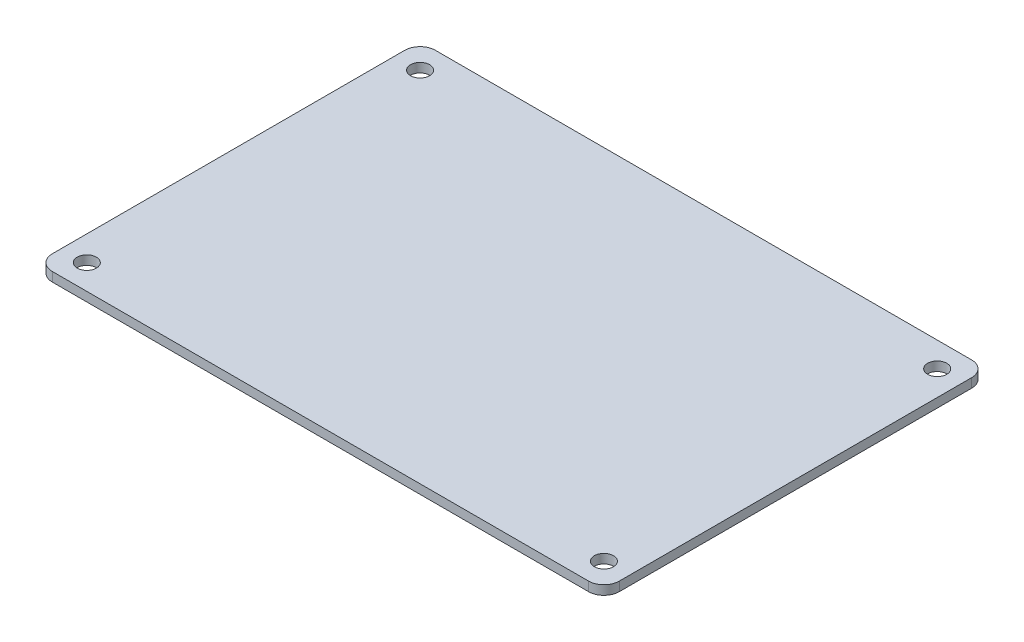
ISO-10303-21;
HEADER;
FILE_DESCRIPTION(('STEP AP214'),'2;1');
FILE_NAME('part.step','',(''),(''),'','','');
FILE_SCHEMA(('AUTOMOTIVE_DESIGN { 1 0 10303 214 1 1 1 1 }'));
ENDSEC;
DATA;
#1=APPLICATION_CONTEXT('core data for automotive mechanical design processes');
#2=APPLICATION_PROTOCOL_DEFINITION('international standard','automotive_design',2000,#1);
#3=PRODUCT_CONTEXT('',#1,'mechanical');
#4=PRODUCT('Part','Part','',(#3));
#5=PRODUCT_RELATED_PRODUCT_CATEGORY('part','',(#4));
#6=PRODUCT_DEFINITION_FORMATION('','',#4);
#7=PRODUCT_DEFINITION_CONTEXT('part definition',#1,'design');
#8=PRODUCT_DEFINITION('design','',#6,#7);
#9=PRODUCT_DEFINITION_SHAPE('','',#8);
#10=(LENGTH_UNIT() NAMED_UNIT(*) SI_UNIT(.MILLI.,.METRE.));
#11=(NAMED_UNIT(*) PLANE_ANGLE_UNIT() SI_UNIT($,.RADIAN.));
#12=(NAMED_UNIT(*) SI_UNIT($,.STERADIAN.) SOLID_ANGLE_UNIT());
#13=UNCERTAINTY_MEASURE_WITH_UNIT(LENGTH_MEASURE(1.E-05),#10,'distance_accuracy_value','');
#14=(GEOMETRIC_REPRESENTATION_CONTEXT(3) GLOBAL_UNCERTAINTY_ASSIGNED_CONTEXT((#13)) GLOBAL_UNIT_ASSIGNED_CONTEXT((#10,
#11,#12)) REPRESENTATION_CONTEXT('',''));
#15=CARTESIAN_POINT('',(0.,0.,0.));
#16=DIRECTION('',(0.,0.,1.));
#17=DIRECTION('',(1.,0.,0.));
#18=AXIS2_PLACEMENT_3D('',#15,#16,#17);
#19=CARTESIAN_POINT('',(2.54,1.524,2.54));
#20=DIRECTION('',(0.,-1.,0.));
#21=DIRECTION('',(0.,0.,-1.));
#22=AXIS2_PLACEMENT_3D('',#19,#20,#21);
#23=CYLINDRICAL_SURFACE('',#22,2.54);
#24=CARTESIAN_POINT('',(2.54,0.,2.54));
#25=DIRECTION('',(0.,1.,0.));
#26=DIRECTION('',(0.,0.,1.));
#27=AXIS2_PLACEMENT_3D('',#24,#25,#26);
#28=CIRCLE('',#27,2.54);
#29=CARTESIAN_POINT('',(2.54000000000002,0.,0.));
#30=VERTEX_POINT('',#29);
#31=CARTESIAN_POINT('',(0.,0.,2.54000000000002));
#32=VERTEX_POINT('',#31);
#33=EDGE_CURVE('E134',#30,#32,#28,.T.);
#34=ORIENTED_EDGE('',*,*,#33,.T.);
#35=DIRECTION('',(0.,-1.,0.));
#36=VECTOR('',#35,1.);
#37=CARTESIAN_POINT('',(0.,1.524,2.54000000000002));
#38=LINE('',#37,#36);
#39=CARTESIAN_POINT('',(0.,1.524,2.54000000000002));
#40=VERTEX_POINT('',#39);
#41=EDGE_CURVE('E11',#40,#32,#38,.T.);
#42=ORIENTED_EDGE('',*,*,#41,.F.);
#43=CARTESIAN_POINT('',(2.54,1.524,2.54));
#44=DIRECTION('',(0.,1.,0.));
#45=DIRECTION('',(0.,0.,1.));
#46=AXIS2_PLACEMENT_3D('',#43,#44,#45);
#47=CIRCLE('',#46,2.54);
#48=CARTESIAN_POINT('',(2.54000000000002,1.524,0.));
#49=VERTEX_POINT('',#48);
#50=EDGE_CURVE('E155',#49,#40,#47,.T.);
#51=ORIENTED_EDGE('',*,*,#50,.F.);
#52=DIRECTION('',(0.,-1.,0.));
#53=VECTOR('',#52,1.);
#54=CARTESIAN_POINT('',(2.54000000000002,1.524,0.));
#55=LINE('',#54,#53);
#56=EDGE_CURVE('E54',#49,#30,#55,.T.);
#57=ORIENTED_EDGE('',*,*,#56,.T.);
#58=EDGE_LOOP('',(#34,#42,#51,#57));
#59=FACE_BOUND('',#58,.T.);
#60=ADVANCED_FACE('F38',(#59),#23,.T.);
#61=CARTESIAN_POINT('',(0.,1.524,2.54000000000002));
#62=DIRECTION('',(1.,0.,0.));
#63=DIRECTION('',(0.,0.,-1.));
#64=AXIS2_PLACEMENT_3D('',#61,#62,#63);
#65=PLANE('',#64);
#66=DIRECTION('',(0.,0.,1.));
#67=VECTOR('',#66,1.);
#68=CARTESIAN_POINT('',(0.,0.,2.54000000000002));
#69=LINE('',#68,#67);
#70=CARTESIAN_POINT('',(0.,0.,60.96));
#71=VERTEX_POINT('',#70);
#72=EDGE_CURVE('E136',#32,#71,#69,.T.);
#73=ORIENTED_EDGE('',*,*,#72,.T.);
#74=DIRECTION('',(0.,-1.,0.));
#75=VECTOR('',#74,1.);
#76=CARTESIAN_POINT('',(0.,1.524,60.96));
#77=LINE('',#76,#75);
#78=CARTESIAN_POINT('',(0.,1.524,60.96));
#79=VERTEX_POINT('',#78);
#80=EDGE_CURVE('E46',#79,#71,#77,.T.);
#81=ORIENTED_EDGE('',*,*,#80,.F.);
#82=DIRECTION('',(0.,0.,1.));
#83=VECTOR('',#82,1.);
#84=CARTESIAN_POINT('',(0.,1.524,2.54000000000002));
#85=LINE('',#84,#83);
#86=EDGE_CURVE('E92',#40,#79,#85,.T.);
#87=ORIENTED_EDGE('',*,*,#86,.F.);
#88=ORIENTED_EDGE('',*,*,#41,.T.);
#89=EDGE_LOOP('',(#73,#81,#87,#88));
#90=FACE_BOUND('',#89,.T.);
#91=ADVANCED_FACE('F168',(#90),#65,.F.);
#92=CARTESIAN_POINT('',(2.54,1.524,60.96));
#93=DIRECTION('',(0.,-1.,0.));
#94=DIRECTION('',(0.,0.,-1.));
#95=AXIS2_PLACEMENT_3D('',#92,#93,#94);
#96=CYLINDRICAL_SURFACE('',#95,2.54);
#97=CARTESIAN_POINT('',(2.54,0.,60.96));
#98=DIRECTION('',(0.,-1.,0.));
#99=DIRECTION('',(0.,0.,-1.));
#100=AXIS2_PLACEMENT_3D('',#97,#98,#99);
#101=CIRCLE('',#100,2.54);
#102=CARTESIAN_POINT('',(2.54000000000002,0.,63.5));
#103=VERTEX_POINT('',#102);
#104=EDGE_CURVE('E140',#103,#71,#101,.T.);
#105=ORIENTED_EDGE('',*,*,#104,.F.);
#106=DIRECTION('',(0.,-1.,0.));
#107=VECTOR('',#106,1.);
#108=CARTESIAN_POINT('',(2.54000000000002,1.524,63.5));
#109=LINE('',#108,#107);
#110=CARTESIAN_POINT('',(2.54000000000002,1.524,63.5));
#111=VERTEX_POINT('',#110);
#112=EDGE_CURVE('E161',#111,#103,#109,.T.);
#113=ORIENTED_EDGE('',*,*,#112,.F.);
#114=CARTESIAN_POINT('',(2.54,1.524,60.96));
#115=DIRECTION('',(0.,-1.,0.));
#116=DIRECTION('',(0.,0.,-1.));
#117=AXIS2_PLACEMENT_3D('',#114,#115,#116);
#118=CIRCLE('',#117,2.54);
#119=EDGE_CURVE('E167',#111,#79,#118,.T.);
#120=ORIENTED_EDGE('',*,*,#119,.T.);
#121=ORIENTED_EDGE('',*,*,#80,.T.);
#122=EDGE_LOOP('',(#105,#113,#120,#121));
#123=FACE_BOUND('',#122,.T.);
#124=ADVANCED_FACE('F165',(#123),#96,.T.);
#125=CARTESIAN_POINT('',(2.54000000000002,1.524,63.5));
#126=DIRECTION('',(0.,0.,-1.));
#127=DIRECTION('',(-1.,0.,0.));
#128=AXIS2_PLACEMENT_3D('',#125,#126,#127);
#129=PLANE('',#128);
#130=DIRECTION('',(1.,0.,0.));
#131=VECTOR('',#130,1.);
#132=CARTESIAN_POINT('',(2.54000000000002,0.,63.5));
#133=LINE('',#132,#131);
#134=CARTESIAN_POINT('',(91.44,0.,63.5));
#135=VERTEX_POINT('',#134);
#136=EDGE_CURVE('E143',#103,#135,#133,.T.);
#137=ORIENTED_EDGE('',*,*,#136,.T.);
#138=DIRECTION('',(0.,-1.,0.));
#139=VECTOR('',#138,1.);
#140=CARTESIAN_POINT('',(91.44,1.524,63.5));
#141=LINE('',#140,#139);
#142=CARTESIAN_POINT('',(91.44,1.524,63.5));
#143=VERTEX_POINT('',#142);
#144=EDGE_CURVE('E159',#143,#135,#141,.T.);
#145=ORIENTED_EDGE('',*,*,#144,.F.);
#146=DIRECTION('',(1.,0.,0.));
#147=VECTOR('',#146,1.);
#148=CARTESIAN_POINT('',(2.54000000000002,1.524,63.5));
#149=LINE('',#148,#147);
#150=EDGE_CURVE('E178',#111,#143,#149,.T.);
#151=ORIENTED_EDGE('',*,*,#150,.F.);
#152=ORIENTED_EDGE('',*,*,#112,.T.);
#153=EDGE_LOOP('',(#137,#145,#151,#152));
#154=FACE_BOUND('',#153,.T.);
#155=ADVANCED_FACE('F176',(#154),#129,.F.);
#156=CARTESIAN_POINT('',(91.4400000000001,1.524,60.96));
#157=DIRECTION('',(0.,-1.,0.));
#158=DIRECTION('',(0.,0.,-1.));
#159=AXIS2_PLACEMENT_3D('',#156,#157,#158);
#160=CYLINDRICAL_SURFACE('',#159,2.54);
#161=CARTESIAN_POINT('',(91.4400000000001,0.,60.96));
#162=DIRECTION('',(0.,-1.,0.));
#163=DIRECTION('',(0.,0.,-1.));
#164=AXIS2_PLACEMENT_3D('',#161,#162,#163);
#165=CIRCLE('',#164,2.54);
#166=CARTESIAN_POINT('',(93.98,0.,60.96));
#167=VERTEX_POINT('',#166);
#168=EDGE_CURVE('E146',#167,#135,#165,.T.);
#169=ORIENTED_EDGE('',*,*,#168,.F.);
#170=DIRECTION('',(0.,-1.,0.));
#171=VECTOR('',#170,1.);
#172=CARTESIAN_POINT('',(93.98,1.524,60.96));
#173=LINE('',#172,#171);
#174=CARTESIAN_POINT('',(93.98,1.524,60.96));
#175=VERTEX_POINT('',#174);
#176=EDGE_CURVE('E117',#175,#167,#173,.T.);
#177=ORIENTED_EDGE('',*,*,#176,.F.);
#178=CARTESIAN_POINT('',(91.4400000000001,1.524,60.96));
#179=DIRECTION('',(0.,-1.,0.));
#180=DIRECTION('',(0.,0.,-1.));
#181=AXIS2_PLACEMENT_3D('',#178,#179,#180);
#182=CIRCLE('',#181,2.54);
#183=EDGE_CURVE('E126',#175,#143,#182,.T.);
#184=ORIENTED_EDGE('',*,*,#183,.T.);
#185=ORIENTED_EDGE('',*,*,#144,.T.);
#186=EDGE_LOOP('',(#169,#177,#184,#185));
#187=FACE_BOUND('',#186,.T.);
#188=ADVANCED_FACE('F184',(#187),#160,.T.);
#189=CARTESIAN_POINT('',(93.98,1.524,2.54000000000002));
#190=DIRECTION('',(1.,0.,0.));
#191=DIRECTION('',(0.,0.,-1.));
#192=AXIS2_PLACEMENT_3D('',#189,#190,#191);
#193=PLANE('',#192);
#194=DIRECTION('',(0.,0.,1.));
#195=VECTOR('',#194,1.);
#196=CARTESIAN_POINT('',(93.98,0.,2.54000000000002));
#197=LINE('',#196,#195);
#198=CARTESIAN_POINT('',(93.98,0.,2.54000000000002));
#199=VERTEX_POINT('',#198);
#200=EDGE_CURVE('E113',#199,#167,#197,.T.);
#201=ORIENTED_EDGE('',*,*,#200,.F.);
#202=DIRECTION('',(0.,-1.,0.));
#203=VECTOR('',#202,1.);
#204=CARTESIAN_POINT('',(93.98,1.524,2.54000000000002));
#205=LINE('',#204,#203);
#206=CARTESIAN_POINT('',(93.98,1.524,2.54000000000002));
#207=VERTEX_POINT('',#206);
#208=EDGE_CURVE('E108',#207,#199,#205,.T.);
#209=ORIENTED_EDGE('',*,*,#208,.F.);
#210=DIRECTION('',(0.,0.,1.));
#211=VECTOR('',#210,1.);
#212=CARTESIAN_POINT('',(93.98,1.524,2.54000000000002));
#213=LINE('',#212,#211);
#214=EDGE_CURVE('E111',#207,#175,#213,.T.);
#215=ORIENTED_EDGE('',*,*,#214,.T.);
#216=ORIENTED_EDGE('',*,*,#176,.T.);
#217=EDGE_LOOP('',(#201,#209,#215,#216));
#218=FACE_BOUND('',#217,.T.);
#219=ADVANCED_FACE('F110',(#218),#193,.T.);
#220=CARTESIAN_POINT('',(91.44,1.524,2.54));
#221=DIRECTION('',(0.,-1.,0.));
#222=DIRECTION('',(0.,0.,-1.));
#223=AXIS2_PLACEMENT_3D('',#220,#221,#222);
#224=CYLINDRICAL_SURFACE('',#223,2.54);
#225=CARTESIAN_POINT('',(91.44,0.,2.54));
#226=DIRECTION('',(0.,-1.,0.));
#227=DIRECTION('',(0.,0.,-1.));
#228=AXIS2_PLACEMENT_3D('',#225,#226,#227);
#229=CIRCLE('',#228,2.54);
#230=CARTESIAN_POINT('',(91.44,0.,0.));
#231=VERTEX_POINT('',#230);
#232=EDGE_CURVE('E150',#231,#199,#229,.T.);
#233=ORIENTED_EDGE('',*,*,#232,.F.);
#234=DIRECTION('',(0.,-1.,0.));
#235=VECTOR('',#234,1.);
#236=CARTESIAN_POINT('',(91.44,1.524,0.));
#237=LINE('',#236,#235);
#238=CARTESIAN_POINT('',(91.44,1.524,0.));
#239=VERTEX_POINT('',#238);
#240=EDGE_CURVE('E80',#239,#231,#237,.T.);
#241=ORIENTED_EDGE('',*,*,#240,.F.);
#242=CARTESIAN_POINT('',(91.44,1.524,2.54));
#243=DIRECTION('',(0.,-1.,0.));
#244=DIRECTION('',(0.,0.,-1.));
#245=AXIS2_PLACEMENT_3D('',#242,#243,#244);
#246=CIRCLE('',#245,2.54);
#247=EDGE_CURVE('E124',#239,#207,#246,.T.);
#248=ORIENTED_EDGE('',*,*,#247,.T.);
#249=ORIENTED_EDGE('',*,*,#208,.T.);
#250=EDGE_LOOP('',(#233,#241,#248,#249));
#251=FACE_BOUND('',#250,.T.);
#252=ADVANCED_FACE('F128',(#251),#224,.T.);
#253=CARTESIAN_POINT('',(2.54000000000002,1.524,0.));
#254=DIRECTION('',(0.,0.,-1.));
#255=DIRECTION('',(-1.,0.,0.));
#256=AXIS2_PLACEMENT_3D('',#253,#254,#255);
#257=PLANE('',#256);
#258=DIRECTION('',(1.,0.,0.));
#259=VECTOR('',#258,1.);
#260=CARTESIAN_POINT('',(2.54000000000002,0.,0.));
#261=LINE('',#260,#259);
#262=EDGE_CURVE('E152',#30,#231,#261,.T.);
#263=ORIENTED_EDGE('',*,*,#262,.F.);
#264=ORIENTED_EDGE('',*,*,#56,.F.);
#265=DIRECTION('',(1.,0.,0.));
#266=VECTOR('',#265,1.);
#267=CARTESIAN_POINT('',(2.54000000000002,1.524,0.));
#268=LINE('',#267,#266);
#269=EDGE_CURVE('E129',#49,#239,#268,.T.);
#270=ORIENTED_EDGE('',*,*,#269,.T.);
#271=ORIENTED_EDGE('',*,*,#240,.T.);
#272=EDGE_LOOP('',(#263,#264,#270,#271));
#273=FACE_BOUND('',#272,.T.);
#274=ADVANCED_FACE('F185',(#273),#257,.T.);
#275=CARTESIAN_POINT('',(2.54,1.524,2.54));
#276=DIRECTION('',(0.,1.,0.));
#277=DIRECTION('',(0.,0.,1.));
#278=AXIS2_PLACEMENT_3D('',#275,#276,#277);
#279=PLANE('',#278);
#280=CARTESIAN_POINT('',(89.8525,1.524,4.12749999999998));
#281=DIRECTION('',(0.,1.,0.));
#282=DIRECTION('',(0.,0.,-1.));
#283=AXIS2_PLACEMENT_3D('',#280,#281,#282);
#284=CIRCLE('',#283,1.5875);
#285=CARTESIAN_POINT('',(89.8525,1.524,2.53999999999998));
#286=VERTEX_POINT('',#285);
#287=EDGE_CURVE('E204',#286,#286,#284,.T.);
#288=ORIENTED_EDGE('',*,*,#287,.F.);
#289=EDGE_LOOP('',(#288));
#290=FACE_BOUND('',#289,.T.);
#291=CARTESIAN_POINT('',(4.1275,1.524,59.3725));
#292=DIRECTION('',(0.,1.,0.));
#293=DIRECTION('',(0.,0.,-1.));
#294=AXIS2_PLACEMENT_3D('',#291,#292,#293);
#295=CIRCLE('',#294,1.5875);
#296=CARTESIAN_POINT('',(4.1275,1.524,57.785));
#297=VERTEX_POINT('',#296);
#298=EDGE_CURVE('E210',#297,#297,#295,.T.);
#299=ORIENTED_EDGE('',*,*,#298,.F.);
#300=EDGE_LOOP('',(#299));
#301=FACE_BOUND('',#300,.T.);
#302=CARTESIAN_POINT('',(89.8525,1.524,59.3725));
#303=DIRECTION('',(0.,1.,0.));
#304=DIRECTION('',(0.,0.,1.));
#305=AXIS2_PLACEMENT_3D('',#302,#303,#304);
#306=CIRCLE('',#305,1.5875);
#307=CARTESIAN_POINT('',(89.8525,1.524,60.96));
#308=VERTEX_POINT('',#307);
#309=EDGE_CURVE('E211',#308,#308,#306,.T.);
#310=ORIENTED_EDGE('',*,*,#309,.F.);
#311=EDGE_LOOP('',(#310));
#312=FACE_BOUND('',#311,.T.);
#313=CARTESIAN_POINT('',(4.1275,1.524,4.1275));
#314=DIRECTION('',(0.,1.,0.));
#315=DIRECTION('',(0.,0.,1.));
#316=AXIS2_PLACEMENT_3D('',#313,#314,#315);
#317=CIRCLE('',#316,1.5875);
#318=CARTESIAN_POINT('',(4.1275,1.524,5.715));
#319=VERTEX_POINT('',#318);
#320=EDGE_CURVE('E201',#319,#319,#317,.T.);
#321=ORIENTED_EDGE('',*,*,#320,.F.);
#322=EDGE_LOOP('',(#321));
#323=FACE_BOUND('',#322,.T.);
#324=ORIENTED_EDGE('',*,*,#50,.T.);
#325=ORIENTED_EDGE('',*,*,#86,.T.);
#326=ORIENTED_EDGE('',*,*,#119,.F.);
#327=ORIENTED_EDGE('',*,*,#150,.T.);
#328=ORIENTED_EDGE('',*,*,#183,.F.);
#329=ORIENTED_EDGE('',*,*,#214,.F.);
#330=ORIENTED_EDGE('',*,*,#247,.F.);
#331=ORIENTED_EDGE('',*,*,#269,.F.);
#332=EDGE_LOOP('',(#324,#325,#326,#327,#328,#329,#330,#331));
#333=FACE_BOUND('',#332,.T.);
#334=ADVANCED_FACE('F122',(#290,#301,#312,#323,#333),#279,.T.);
#335=CARTESIAN_POINT('',(2.54,0.,2.54));
#336=DIRECTION('',(0.,1.,0.));
#337=DIRECTION('',(0.,0.,1.));
#338=AXIS2_PLACEMENT_3D('',#335,#336,#337);
#339=PLANE('',#338);
#340=CARTESIAN_POINT('',(89.8525,0.,4.12749999999998));
#341=DIRECTION('',(0.,1.,0.));
#342=DIRECTION('',(0.,0.,-1.));
#343=AXIS2_PLACEMENT_3D('',#340,#341,#342);
#344=CIRCLE('',#343,1.5875);
#345=CARTESIAN_POINT('',(89.8525,0.,2.53999999999998));
#346=VERTEX_POINT('',#345);
#347=EDGE_CURVE('E214',#346,#346,#344,.T.);
#348=ORIENTED_EDGE('',*,*,#347,.T.);
#349=EDGE_LOOP('',(#348));
#350=FACE_BOUND('',#349,.T.);
#351=CARTESIAN_POINT('',(4.1275,0.,59.3725));
#352=DIRECTION('',(0.,1.,0.));
#353=DIRECTION('',(0.,0.,-1.));
#354=AXIS2_PLACEMENT_3D('',#351,#352,#353);
#355=CIRCLE('',#354,1.5875);
#356=CARTESIAN_POINT('',(4.1275,0.,57.785));
#357=VERTEX_POINT('',#356);
#358=EDGE_CURVE('E207',#357,#357,#355,.T.);
#359=ORIENTED_EDGE('',*,*,#358,.T.);
#360=EDGE_LOOP('',(#359));
#361=FACE_BOUND('',#360,.T.);
#362=CARTESIAN_POINT('',(89.8525,0.,59.3725));
#363=DIRECTION('',(0.,1.,0.));
#364=DIRECTION('',(0.,0.,1.));
#365=AXIS2_PLACEMENT_3D('',#362,#363,#364);
#366=CIRCLE('',#365,1.5875);
#367=CARTESIAN_POINT('',(89.8525,0.,60.96));
#368=VERTEX_POINT('',#367);
#369=EDGE_CURVE('E219',#368,#368,#366,.T.);
#370=ORIENTED_EDGE('',*,*,#369,.T.);
#371=EDGE_LOOP('',(#370));
#372=FACE_BOUND('',#371,.T.);
#373=CARTESIAN_POINT('',(4.1275,0.,4.1275));
#374=DIRECTION('',(0.,1.,0.));
#375=DIRECTION('',(0.,0.,1.));
#376=AXIS2_PLACEMENT_3D('',#373,#374,#375);
#377=CIRCLE('',#376,1.5875);
#378=CARTESIAN_POINT('',(4.1275,0.,5.715));
#379=VERTEX_POINT('',#378);
#380=EDGE_CURVE('E137',#379,#379,#377,.T.);
#381=ORIENTED_EDGE('',*,*,#380,.T.);
#382=EDGE_LOOP('',(#381));
#383=FACE_BOUND('',#382,.T.);
#384=ORIENTED_EDGE('',*,*,#33,.F.);
#385=ORIENTED_EDGE('',*,*,#262,.T.);
#386=ORIENTED_EDGE('',*,*,#232,.T.);
#387=ORIENTED_EDGE('',*,*,#200,.T.);
#388=ORIENTED_EDGE('',*,*,#168,.T.);
#389=ORIENTED_EDGE('',*,*,#136,.F.);
#390=ORIENTED_EDGE('',*,*,#104,.T.);
#391=ORIENTED_EDGE('',*,*,#72,.F.);
#392=EDGE_LOOP('',(#384,#385,#386,#387,#388,#389,#390,#391));
#393=FACE_BOUND('',#392,.T.);
#394=ADVANCED_FACE('F172',(#350,#361,#372,#383,#393),#339,.F.);
#395=CARTESIAN_POINT('',(4.1275,0.,4.1275));
#396=DIRECTION('',(0.,1.,0.));
#397=DIRECTION('',(0.,0.,1.));
#398=AXIS2_PLACEMENT_3D('',#395,#396,#397);
#399=CYLINDRICAL_SURFACE('',#398,1.5875);
#400=ORIENTED_EDGE('',*,*,#380,.F.);
#401=EDGE_LOOP('',(#400));
#402=FACE_BOUND('',#401,.T.);
#403=ORIENTED_EDGE('',*,*,#320,.T.);
#404=EDGE_LOOP('',(#403));
#405=FACE_BOUND('',#404,.T.);
#406=ADVANCED_FACE('F230',(#402,#405),#399,.F.);
#407=CARTESIAN_POINT('',(89.8525,0.,59.3725));
#408=DIRECTION('',(0.,1.,0.));
#409=DIRECTION('',(0.,0.,1.));
#410=AXIS2_PLACEMENT_3D('',#407,#408,#409);
#411=CYLINDRICAL_SURFACE('',#410,1.5875);
#412=ORIENTED_EDGE('',*,*,#369,.F.);
#413=EDGE_LOOP('',(#412));
#414=FACE_BOUND('',#413,.T.);
#415=ORIENTED_EDGE('',*,*,#309,.T.);
#416=EDGE_LOOP('',(#415));
#417=FACE_BOUND('',#416,.T.);
#418=ADVANCED_FACE('F225',(#414,#417),#411,.F.);
#419=CARTESIAN_POINT('',(4.1275,0.,59.3725));
#420=DIRECTION('',(0.,1.,0.));
#421=DIRECTION('',(0.,0.,1.));
#422=AXIS2_PLACEMENT_3D('',#419,#420,#421);
#423=CYLINDRICAL_SURFACE('',#422,1.5875);
#424=ORIENTED_EDGE('',*,*,#358,.F.);
#425=EDGE_LOOP('',(#424));
#426=FACE_BOUND('',#425,.T.);
#427=ORIENTED_EDGE('',*,*,#298,.T.);
#428=EDGE_LOOP('',(#427));
#429=FACE_BOUND('',#428,.T.);
#430=ADVANCED_FACE('F238',(#426,#429),#423,.F.);
#431=CARTESIAN_POINT('',(89.8525,0.,4.12749999999998));
#432=DIRECTION('',(0.,1.,0.));
#433=DIRECTION('',(0.,0.,1.));
#434=AXIS2_PLACEMENT_3D('',#431,#432,#433);
#435=CYLINDRICAL_SURFACE('',#434,1.5875);
#436=ORIENTED_EDGE('',*,*,#347,.F.);
#437=EDGE_LOOP('',(#436));
#438=FACE_BOUND('',#437,.T.);
#439=ORIENTED_EDGE('',*,*,#287,.T.);
#440=EDGE_LOOP('',(#439));
#441=FACE_BOUND('',#440,.T.);
#442=ADVANCED_FACE('F246',(#438,#441),#435,.F.);
#443=CLOSED_SHELL('',(#60,#91,#124,#155,#188,#219,#252,#274,#334,#394,#406,#418,#430,#442));
#444=MANIFOLD_SOLID_BREP('B2',#443);
#445=ADVANCED_BREP_SHAPE_REPRESENTATION('',(#18,#444),#14);
#446=SHAPE_DEFINITION_REPRESENTATION(#9,#445);
ENDSEC;
END-ISO-10303-21;
